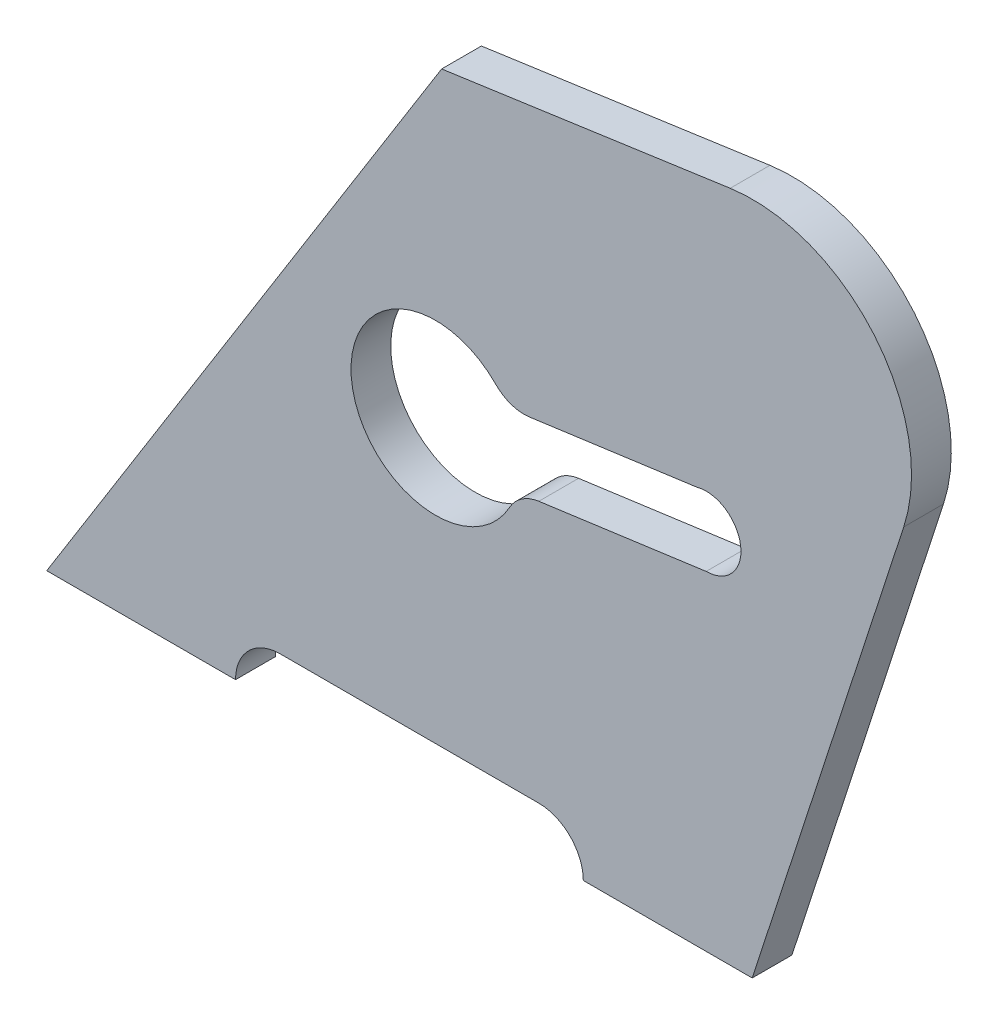
ISO-10303-21;
HEADER;
FILE_DESCRIPTION(('STEP AP214'),'2;1');
FILE_NAME('part.step','',(''),(''),'','','');
FILE_SCHEMA(('AUTOMOTIVE_DESIGN { 1 0 10303 214 1 1 1 1 }'));
ENDSEC;
DATA;
#1=APPLICATION_CONTEXT('core data for automotive mechanical design processes');
#2=APPLICATION_PROTOCOL_DEFINITION('international standard','automotive_design',2000,#1);
#3=PRODUCT_CONTEXT('',#1,'mechanical');
#4=PRODUCT('Part','Part','',(#3));
#5=PRODUCT_RELATED_PRODUCT_CATEGORY('part','',(#4));
#6=PRODUCT_DEFINITION_FORMATION('','',#4);
#7=PRODUCT_DEFINITION_CONTEXT('part definition',#1,'design');
#8=PRODUCT_DEFINITION('design','',#6,#7);
#9=PRODUCT_DEFINITION_SHAPE('','',#8);
#10=(LENGTH_UNIT() NAMED_UNIT(*) SI_UNIT(.MILLI.,.METRE.));
#11=(NAMED_UNIT(*) PLANE_ANGLE_UNIT() SI_UNIT($,.RADIAN.));
#12=(NAMED_UNIT(*) SI_UNIT($,.STERADIAN.) SOLID_ANGLE_UNIT());
#13=UNCERTAINTY_MEASURE_WITH_UNIT(LENGTH_MEASURE(1.E-05),#10,'distance_accuracy_value','');
#14=(GEOMETRIC_REPRESENTATION_CONTEXT(3) GLOBAL_UNCERTAINTY_ASSIGNED_CONTEXT((#13)) GLOBAL_UNIT_ASSIGNED_CONTEXT((#10,
#11,#12)) REPRESENTATION_CONTEXT('',''));
#15=CARTESIAN_POINT('',(0.,0.,0.));
#16=DIRECTION('',(0.,0.,1.));
#17=DIRECTION('',(1.,0.,0.));
#18=AXIS2_PLACEMENT_3D('',#15,#16,#17);
#19=CARTESIAN_POINT('',(128.440206600621,-41.7327529127653,8.));
#20=DIRECTION('',(-0.951056516295154,0.309016994374945,0.));
#21=DIRECTION('',(-0.309016994374945,-0.951056516295154,0.));
#22=AXIS2_PLACEMENT_3D('',#19,#20,#21);
#23=PLANE('',#22);
#24=DIRECTION('',(0.309016994374945,0.951056516295154,0.));
#25=VECTOR('',#24,1.);
#26=CARTESIAN_POINT('',(128.440206600621,-41.7327529127653,0.));
#27=LINE('',#26,#25);
#28=CARTESIAN_POINT('',(142.,0.,0.));
#29=VERTEX_POINT('',#28);
#30=CARTESIAN_POINT('',(172.503548140475,93.8802679373731,0.));
#31=VERTEX_POINT('',#30);
#32=EDGE_CURVE('E213',#29,#31,#27,.T.);
#33=ORIENTED_EDGE('',*,*,#32,.T.);
#34=DIRECTION('',(0.,0.,-1.));
#35=VECTOR('',#34,1.);
#36=CARTESIAN_POINT('',(172.503548140475,93.8802679373731,8.));
#37=LINE('',#36,#35);
#38=CARTESIAN_POINT('',(172.503548140475,93.8802679373731,8.));
#39=VERTEX_POINT('',#38);
#40=EDGE_CURVE('E11',#39,#31,#37,.T.);
#41=ORIENTED_EDGE('',*,*,#40,.F.);
#42=DIRECTION('',(0.309016994374945,0.951056516295154,0.));
#43=VECTOR('',#42,1.);
#44=CARTESIAN_POINT('',(128.440206600621,-41.7327529127653,8.));
#45=LINE('',#44,#43);
#46=CARTESIAN_POINT('',(142.,0.,8.));
#47=VERTEX_POINT('',#46);
#48=EDGE_CURVE('E317',#47,#39,#45,.T.);
#49=ORIENTED_EDGE('',*,*,#48,.F.);
#50=DIRECTION('',(0.,0.,-1.));
#51=VECTOR('',#50,1.);
#52=CARTESIAN_POINT('',(142.,0.,8.));
#53=LINE('',#52,#51);
#54=EDGE_CURVE('E242',#47,#29,#53,.T.);
#55=ORIENTED_EDGE('',*,*,#54,.T.);
#56=EDGE_LOOP('',(#33,#41,#49,#55));
#57=FACE_BOUND('',#56,.T.);
#58=ADVANCED_FACE('F45',(#57),#23,.F.);
#59=CARTESIAN_POINT('',(142.06973961903,103.768811757372,8.));
#60=DIRECTION('',(0.,0.,-1.));
#61=DIRECTION('',(-1.,0.,0.));
#62=AXIS2_PLACEMENT_3D('',#59,#60,#61);
#63=CYLINDRICAL_SURFACE('',#62,32.);
#64=CARTESIAN_POINT('',(142.06973961903,103.768811757372,0.));
#65=DIRECTION('',(0.,0.,1.));
#66=DIRECTION('',(1.,0.,0.));
#67=AXIS2_PLACEMENT_3D('',#64,#65,#66);
#68=CIRCLE('',#67,32.);
#69=CARTESIAN_POINT('',(137.573015723533,135.451290735628,0.));
#70=VERTEX_POINT('',#69);
#71=EDGE_CURVE('E217',#31,#70,#68,.T.);
#72=ORIENTED_EDGE('',*,*,#71,.T.);
#73=DIRECTION('',(0.,0.,-1.));
#74=VECTOR('',#73,1.);
#75=CARTESIAN_POINT('',(137.573015723533,135.451290735628,8.));
#76=LINE('',#75,#74);
#77=CARTESIAN_POINT('',(137.573015723533,135.451290735628,8.));
#78=VERTEX_POINT('',#77);
#79=EDGE_CURVE('E56',#78,#70,#76,.T.);
#80=ORIENTED_EDGE('',*,*,#79,.F.);
#81=CARTESIAN_POINT('',(142.06973961903,103.768811757372,8.));
#82=DIRECTION('',(0.,0.,1.));
#83=DIRECTION('',(1.,0.,0.));
#84=AXIS2_PLACEMENT_3D('',#81,#82,#83);
#85=CIRCLE('',#84,32.);
#86=EDGE_CURVE('E320',#39,#78,#85,.T.);
#87=ORIENTED_EDGE('',*,*,#86,.F.);
#88=ORIENTED_EDGE('',*,*,#40,.T.);
#89=EDGE_LOOP('',(#72,#80,#87,#88));
#90=FACE_BOUND('',#89,.T.);
#91=ADVANCED_FACE('F357',(#90),#63,.T.);
#92=CARTESIAN_POINT('',(-16.1285050060779,113.636290037189,8.));
#93=DIRECTION('',(0.140522621734258,-0.99007746807052,0.));
#94=DIRECTION('',(0.99007746807052,0.140522621734258,0.));
#95=AXIS2_PLACEMENT_3D('',#92,#93,#94);
#96=PLANE('',#95);
#97=DIRECTION('',(-0.99007746807052,-0.140522621734258,0.));
#98=VECTOR('',#97,1.);
#99=CARTESIAN_POINT('',(-16.1285050060779,113.636290037189,0.));
#100=LINE('',#99,#98);
#101=CARTESIAN_POINT('',(79.4878896349813,127.207214423464,0.));
#102=VERTEX_POINT('',#101);
#103=EDGE_CURVE('E220',#70,#102,#100,.T.);
#104=ORIENTED_EDGE('',*,*,#103,.T.);
#105=DIRECTION('',(0.,0.,-1.));
#106=VECTOR('',#105,1.);
#107=CARTESIAN_POINT('',(79.4878896349813,127.207214423464,8.));
#108=LINE('',#107,#106);
#109=CARTESIAN_POINT('',(79.4878896349813,127.207214423464,8.));
#110=VERTEX_POINT('',#109);
#111=EDGE_CURVE('E256',#110,#102,#108,.T.);
#112=ORIENTED_EDGE('',*,*,#111,.F.);
#113=DIRECTION('',(-0.99007746807052,-0.140522621734258,0.));
#114=VECTOR('',#113,1.);
#115=CARTESIAN_POINT('',(-16.1285050060779,113.636290037189,8.));
#116=LINE('',#115,#114);
#117=EDGE_CURVE('E323',#78,#110,#116,.T.);
#118=ORIENTED_EDGE('',*,*,#117,.F.);
#119=ORIENTED_EDGE('',*,*,#79,.T.);
#120=EDGE_LOOP('',(#104,#112,#118,#119));
#121=FACE_BOUND('',#120,.T.);
#122=ADVANCED_FACE('F362',(#121),#96,.F.);
#123=CARTESIAN_POINT('',(0.,0.,8.));
#124=DIRECTION('',(0.848048096156424,-0.529919264233209,0.));
#125=DIRECTION('',(0.529919264233209,0.848048096156424,0.));
#126=AXIS2_PLACEMENT_3D('',#123,#124,#125);
#127=PLANE('',#126);
#128=DIRECTION('',(-0.529919264233209,-0.848048096156424,0.));
#129=VECTOR('',#128,1.);
#130=CARTESIAN_POINT('',(0.,0.,0.));
#131=LINE('',#130,#129);
#132=CARTESIAN_POINT('',(0.,0.,0.));
#133=VERTEX_POINT('',#132);
#134=EDGE_CURVE('E223',#102,#133,#131,.T.);
#135=ORIENTED_EDGE('',*,*,#134,.T.);
#136=DIRECTION('',(0.,0.,-1.));
#137=VECTOR('',#136,1.);
#138=CARTESIAN_POINT('',(0.,0.,8.));
#139=LINE('',#138,#137);
#140=CARTESIAN_POINT('',(0.,0.,8.));
#141=VERTEX_POINT('',#140);
#142=EDGE_CURVE('E252',#141,#133,#139,.T.);
#143=ORIENTED_EDGE('',*,*,#142,.F.);
#144=DIRECTION('',(-0.529919264233209,-0.848048096156424,0.));
#145=VECTOR('',#144,1.);
#146=CARTESIAN_POINT('',(0.,0.,8.));
#147=LINE('',#146,#145);
#148=EDGE_CURVE('E326',#110,#141,#147,.T.);
#149=ORIENTED_EDGE('',*,*,#148,.F.);
#150=ORIENTED_EDGE('',*,*,#111,.T.);
#151=EDGE_LOOP('',(#135,#143,#149,#150));
#152=FACE_BOUND('',#151,.T.);
#153=ADVANCED_FACE('F390',(#152),#127,.F.);
#154=CARTESIAN_POINT('',(0.,0.,8.));
#155=DIRECTION('',(0.,1.,0.));
#156=DIRECTION('',(0.,0.,1.));
#157=AXIS2_PLACEMENT_3D('',#154,#155,#156);
#158=PLANE('',#157);
#159=DIRECTION('',(1.,0.,0.));
#160=VECTOR('',#159,1.);
#161=CARTESIAN_POINT('',(0.,0.,0.));
#162=LINE('',#161,#160);
#163=CARTESIAN_POINT('',(38.,0.,0.));
#164=VERTEX_POINT('',#163);
#165=EDGE_CURVE('E226',#133,#164,#162,.T.);
#166=ORIENTED_EDGE('',*,*,#165,.T.);
#167=DIRECTION('',(0.,0.,-1.));
#168=VECTOR('',#167,1.);
#169=CARTESIAN_POINT('',(38.,0.,8.));
#170=LINE('',#169,#168);
#171=CARTESIAN_POINT('',(38.,0.,8.));
#172=VERTEX_POINT('',#171);
#173=EDGE_CURVE('E249',#172,#164,#170,.T.);
#174=ORIENTED_EDGE('',*,*,#173,.F.);
#175=DIRECTION('',(1.,0.,0.));
#176=VECTOR('',#175,1.);
#177=CARTESIAN_POINT('',(0.,0.,8.));
#178=LINE('',#177,#176);
#179=EDGE_CURVE('E329',#141,#172,#178,.T.);
#180=ORIENTED_EDGE('',*,*,#179,.F.);
#181=ORIENTED_EDGE('',*,*,#142,.T.);
#182=EDGE_LOOP('',(#166,#174,#180,#181));
#183=FACE_BOUND('',#182,.T.);
#184=ADVANCED_FACE('F387',(#183),#158,.F.);
#185=CARTESIAN_POINT('',(47.,0.,8.));
#186=DIRECTION('',(0.,0.,-1.));
#187=DIRECTION('',(-1.,0.,0.));
#188=AXIS2_PLACEMENT_3D('',#185,#186,#187);
#189=CYLINDRICAL_SURFACE('',#188,9.);
#190=CARTESIAN_POINT('',(47.,0.,0.));
#191=DIRECTION('',(0.,0.,1.));
#192=DIRECTION('',(1.,0.,0.));
#193=AXIS2_PLACEMENT_3D('',#190,#191,#192);
#194=CIRCLE('',#193,9.);
#195=CARTESIAN_POINT('',(47.,9.,0.));
#196=VERTEX_POINT('',#195);
#197=EDGE_CURVE('E230',#196,#164,#194,.T.);
#198=ORIENTED_EDGE('',*,*,#197,.F.);
#199=DIRECTION('',(0.,0.,-1.));
#200=VECTOR('',#199,1.);
#201=CARTESIAN_POINT('',(47.,9.,8.));
#202=LINE('',#201,#200);
#203=CARTESIAN_POINT('',(47.,9.,8.));
#204=VERTEX_POINT('',#203);
#205=EDGE_CURVE('E180',#204,#196,#202,.T.);
#206=ORIENTED_EDGE('',*,*,#205,.F.);
#207=CARTESIAN_POINT('',(47.,0.,8.));
#208=DIRECTION('',(0.,0.,1.));
#209=DIRECTION('',(1.,0.,0.));
#210=AXIS2_PLACEMENT_3D('',#207,#208,#209);
#211=CIRCLE('',#210,9.);
#212=EDGE_CURVE('E167',#204,#172,#211,.T.);
#213=ORIENTED_EDGE('',*,*,#212,.T.);
#214=ORIENTED_EDGE('',*,*,#173,.T.);
#215=EDGE_LOOP('',(#198,#206,#213,#214));
#216=FACE_BOUND('',#215,.T.);
#217=ADVANCED_FACE('F334',(#216),#189,.F.);
#218=CARTESIAN_POINT('',(0.,9.,8.));
#219=DIRECTION('',(0.,1.,0.));
#220=DIRECTION('',(0.,0.,1.));
#221=AXIS2_PLACEMENT_3D('',#218,#219,#220);
#222=PLANE('',#221);
#223=DIRECTION('',(1.,0.,0.));
#224=VECTOR('',#223,1.);
#225=CARTESIAN_POINT('',(0.,9.,0.));
#226=LINE('',#225,#224);
#227=CARTESIAN_POINT('',(99.,9.,0.));
#228=VERTEX_POINT('',#227);
#229=EDGE_CURVE('E175',#196,#228,#226,.T.);
#230=ORIENTED_EDGE('',*,*,#229,.T.);
#231=DIRECTION('',(0.,0.,-1.));
#232=VECTOR('',#231,1.);
#233=CARTESIAN_POINT('',(99.,9.,8.));
#234=LINE('',#233,#232);
#235=CARTESIAN_POINT('',(99.,9.,8.));
#236=VERTEX_POINT('',#235);
#237=EDGE_CURVE('E172',#236,#228,#234,.T.);
#238=ORIENTED_EDGE('',*,*,#237,.F.);
#239=DIRECTION('',(1.,0.,0.));
#240=VECTOR('',#239,1.);
#241=CARTESIAN_POINT('',(0.,9.,8.));
#242=LINE('',#241,#240);
#243=EDGE_CURVE('E161',#204,#236,#242,.T.);
#244=ORIENTED_EDGE('',*,*,#243,.F.);
#245=ORIENTED_EDGE('',*,*,#205,.T.);
#246=EDGE_LOOP('',(#230,#238,#244,#245));
#247=FACE_BOUND('',#246,.T.);
#248=ADVANCED_FACE('F173',(#247),#222,.F.);
#249=CARTESIAN_POINT('',(99.,0.,8.));
#250=DIRECTION('',(0.,0.,-1.));
#251=DIRECTION('',(-1.,0.,0.));
#252=AXIS2_PLACEMENT_3D('',#249,#250,#251);
#253=CYLINDRICAL_SURFACE('',#252,9.);
#254=CARTESIAN_POINT('',(99.,0.,0.));
#255=DIRECTION('',(0.,0.,1.));
#256=DIRECTION('',(1.,0.,0.));
#257=AXIS2_PLACEMENT_3D('',#254,#255,#256);
#258=CIRCLE('',#257,9.);
#259=CARTESIAN_POINT('',(108.,0.,0.));
#260=VERTEX_POINT('',#259);
#261=EDGE_CURVE('E236',#260,#228,#258,.T.);
#262=ORIENTED_EDGE('',*,*,#261,.F.);
#263=DIRECTION('',(0.,0.,-1.));
#264=VECTOR('',#263,1.);
#265=CARTESIAN_POINT('',(108.,0.,8.));
#266=LINE('',#265,#264);
#267=CARTESIAN_POINT('',(108.,0.,8.));
#268=VERTEX_POINT('',#267);
#269=EDGE_CURVE('E114',#268,#260,#266,.T.);
#270=ORIENTED_EDGE('',*,*,#269,.F.);
#271=CARTESIAN_POINT('',(99.,0.,8.));
#272=DIRECTION('',(0.,0.,1.));
#273=DIRECTION('',(1.,0.,0.));
#274=AXIS2_PLACEMENT_3D('',#271,#272,#273);
#275=CIRCLE('',#274,9.);
#276=EDGE_CURVE('E165',#268,#236,#275,.T.);
#277=ORIENTED_EDGE('',*,*,#276,.T.);
#278=ORIENTED_EDGE('',*,*,#237,.T.);
#279=EDGE_LOOP('',(#262,#270,#277,#278));
#280=FACE_BOUND('',#279,.T.);
#281=ADVANCED_FACE('F182',(#280),#253,.F.);
#282=CARTESIAN_POINT('',(96.0798171445693,83.2965016603901,8.));
#283=DIRECTION('',(0.,0.,-1.));
#284=DIRECTION('',(-1.,0.,0.));
#285=AXIS2_PLACEMENT_3D('',#282,#283,#284);
#286=CYLINDRICAL_SURFACE('',#285,8.);
#287=CARTESIAN_POINT('',(96.0798171445693,83.2965016603901,0.));
#288=DIRECTION('',(0.,0.,1.));
#289=DIRECTION('',(1.,0.,0.));
#290=AXIS2_PLACEMENT_3D('',#287,#288,#289);
#291=CIRCLE('',#290,8.);
#292=CARTESIAN_POINT('',(97.1659290276469,75.3705720002532,0.));
#293=VERTEX_POINT('',#292);
#294=CARTESIAN_POINT('',(90.3725659843101,77.6904973619864,0.));
#295=VERTEX_POINT('',#294);
#296=EDGE_CURVE('E190',#293,#295,#291,.F.);
#297=ORIENTED_EDGE('',*,*,#296,.F.);
#298=DIRECTION('',(0.,0.,-1.));
#299=VECTOR('',#298,1.);
#300=CARTESIAN_POINT('',(97.1659290276469,75.3705720002532,8.));
#301=LINE('',#300,#299);
#302=CARTESIAN_POINT('',(97.1659290276469,75.3705720002532,8.));
#303=VERTEX_POINT('',#302);
#304=EDGE_CURVE('E49',#303,#293,#301,.T.);
#305=ORIENTED_EDGE('',*,*,#304,.F.);
#306=CARTESIAN_POINT('',(96.0798171445693,83.2965016603901,8.));
#307=DIRECTION('',(0.,0.,1.));
#308=DIRECTION('',(1.,0.,0.));
#309=AXIS2_PLACEMENT_3D('',#306,#307,#308);
#310=CIRCLE('',#309,8.);
#311=CARTESIAN_POINT('',(90.3725659843101,77.6904973619864,8.));
#312=VERTEX_POINT('',#311);
#313=EDGE_CURVE('E241',#303,#312,#310,.F.);
#314=ORIENTED_EDGE('',*,*,#313,.T.);
#315=DIRECTION('',(0.,0.,-1.));
#316=VECTOR('',#315,1.);
#317=CARTESIAN_POINT('',(90.3725659843101,77.6904973619864,8.));
#318=LINE('',#317,#316);
#319=EDGE_CURVE('E186',#312,#295,#318,.T.);
#320=ORIENTED_EDGE('',*,*,#319,.T.);
#321=EDGE_LOOP('',(#297,#305,#314,#320));
#322=FACE_BOUND('',#321,.T.);
#323=ADVANCED_FACE('F47',(#322),#286,.T.);
#324=CARTESIAN_POINT('',(-8.34691885587556,60.9118570207322,8.));
#325=DIRECTION('',(0.135763985384698,-0.990741207517111,0.));
#326=DIRECTION('',(0.990741207517111,0.135763985384698,0.));
#327=AXIS2_PLACEMENT_3D('',#324,#325,#326);
#328=PLANE('',#327);
#329=DIRECTION('',(-0.990741207517111,-0.135763985384698,0.));
#330=VECTOR('',#329,1.);
#331=CARTESIAN_POINT('',(-8.34691885587556,60.9118570207322,0.));
#332=LINE('',#331,#330);
#333=CARTESIAN_POINT('',(130.852326034757,79.9867113878515,0.));
#334=VERTEX_POINT('',#333);
#335=EDGE_CURVE('E194',#334,#293,#332,.T.);
#336=ORIENTED_EDGE('',*,*,#335,.F.);
#337=DIRECTION('',(0.,0.,-1.));
#338=VECTOR('',#337,1.);
#339=CARTESIAN_POINT('',(130.852326034757,79.9867113878515,8.));
#340=LINE('',#339,#338);
#341=CARTESIAN_POINT('',(130.852326034757,79.9867113878515,8.));
#342=VERTEX_POINT('',#341);
#343=EDGE_CURVE('E274',#342,#334,#340,.T.);
#344=ORIENTED_EDGE('',*,*,#343,.F.);
#345=DIRECTION('',(-0.990741207517111,-0.135763985384698,0.));
#346=VECTOR('',#345,1.);
#347=CARTESIAN_POINT('',(-8.34691885587556,60.9118570207322,8.));
#348=LINE('',#347,#346);
#349=EDGE_CURVE('E285',#342,#303,#348,.T.);
#350=ORIENTED_EDGE('',*,*,#349,.T.);
#351=ORIENTED_EDGE('',*,*,#304,.T.);
#352=EDGE_LOOP('',(#336,#344,#350,#351));
#353=FACE_BOUND('',#352,.T.);
#354=ADVANCED_FACE('F283',(#353),#328,.T.);
#355=CARTESIAN_POINT('',(132.735423682201,73.244757424037,8.));
#356=DIRECTION('',(0.,0.,-1.));
#357=DIRECTION('',(-1.,0.,0.));
#358=AXIS2_PLACEMENT_3D('',#355,#356,#357);
#359=CYLINDRICAL_SURFACE('',#358,7.00000000000002);
#360=CARTESIAN_POINT('',(132.735423682201,73.244757424037,0.));
#361=DIRECTION('',(0.,0.,1.));
#362=DIRECTION('',(1.,0.,0.));
#363=AXIS2_PLACEMENT_3D('',#360,#361,#362);
#364=CIRCLE('',#363,7.00000000000002);
#365=CARTESIAN_POINT('',(132.7354236822,66.244757424037,0.));
#366=VERTEX_POINT('',#365);
#367=EDGE_CURVE('E198',#366,#334,#364,.T.);
#368=ORIENTED_EDGE('',*,*,#367,.F.);
#369=DIRECTION('',(0.,0.,-1.));
#370=VECTOR('',#369,1.);
#371=CARTESIAN_POINT('',(132.7354236822,66.244757424037,8.));
#372=LINE('',#371,#370);
#373=CARTESIAN_POINT('',(132.7354236822,66.244757424037,8.));
#374=VERTEX_POINT('',#373);
#375=EDGE_CURVE('E272',#374,#366,#372,.T.);
#376=ORIENTED_EDGE('',*,*,#375,.F.);
#377=CARTESIAN_POINT('',(132.735423682201,73.244757424037,8.));
#378=DIRECTION('',(0.,0.,1.));
#379=DIRECTION('',(1.,0.,0.));
#380=AXIS2_PLACEMENT_3D('',#377,#378,#379);
#381=CIRCLE('',#380,7.00000000000002);
#382=EDGE_CURVE('E295',#374,#342,#381,.T.);
#383=ORIENTED_EDGE('',*,*,#382,.T.);
#384=ORIENTED_EDGE('',*,*,#343,.T.);
#385=EDGE_LOOP('',(#368,#376,#383,#384));
#386=FACE_BOUND('',#385,.T.);
#387=ADVANCED_FACE('F292',(#386),#359,.F.);
#388=CARTESIAN_POINT('',(-6.46382120843234,47.1699030569178,8.));
#389=DIRECTION('',(0.135763985384697,-0.990741207517111,0.));
#390=DIRECTION('',(0.990741207517111,0.135763985384697,0.));
#391=AXIS2_PLACEMENT_3D('',#388,#389,#390);
#392=PLANE('',#391);
#393=DIRECTION('',(-0.990741207517111,-0.135763985384697,0.));
#394=VECTOR('',#393,1.);
#395=CARTESIAN_POINT('',(-6.46382120843234,47.1699030569178,0.));
#396=LINE('',#395,#394);
#397=CARTESIAN_POINT('',(99.0490266750901,61.6286180364387,0.));
#398=VERTEX_POINT('',#397);
#399=EDGE_CURVE('E202',#366,#398,#396,.T.);
#400=ORIENTED_EDGE('',*,*,#399,.T.);
#401=DIRECTION('',(0.,0.,-1.));
#402=VECTOR('',#401,1.);
#403=CARTESIAN_POINT('',(99.0490266750901,61.6286180364387,8.));
#404=LINE('',#403,#402);
#405=CARTESIAN_POINT('',(99.0490266750901,61.6286180364387,8.));
#406=VERTEX_POINT('',#405);
#407=EDGE_CURVE('E268',#406,#398,#404,.T.);
#408=ORIENTED_EDGE('',*,*,#407,.F.);
#409=DIRECTION('',(-0.990741207517111,-0.135763985384697,0.));
#410=VECTOR('',#409,1.);
#411=CARTESIAN_POINT('',(-6.46382120843234,47.1699030569178,8.));
#412=LINE('',#411,#410);
#413=EDGE_CURVE('E298',#374,#406,#412,.T.);
#414=ORIENTED_EDGE('',*,*,#413,.F.);
#415=ORIENTED_EDGE('',*,*,#375,.T.);
#416=EDGE_LOOP('',(#400,#408,#414,#415));
#417=FACE_BOUND('',#416,.T.);
#418=ADVANCED_FACE('F299',(#417),#392,.F.);
#419=CARTESIAN_POINT('',(100.135138558168,53.7026883763018,8.));
#420=DIRECTION('',(0.,0.,-1.));
#421=DIRECTION('',(-1.,0.,0.));
#422=AXIS2_PLACEMENT_3D('',#419,#420,#421);
#423=CYLINDRICAL_SURFACE('',#422,7.99999999999999);
#424=CARTESIAN_POINT('',(100.135138558168,53.7026883763018,0.));
#425=DIRECTION('',(0.,0.,1.));
#426=DIRECTION('',(1.,0.,0.));
#427=AXIS2_PLACEMENT_3D('',#424,#425,#426);
#428=CIRCLE('',#427,7.99999999999999);
#429=CARTESIAN_POINT('',(93.130184545557,57.5667043288064,0.));
#430=VERTEX_POINT('',#429);
#431=EDGE_CURVE('E205',#398,#430,#428,.T.);
#432=ORIENTED_EDGE('',*,*,#431,.T.);
#433=DIRECTION('',(0.,0.,-1.));
#434=VECTOR('',#433,1.);
#435=CARTESIAN_POINT('',(93.130184545557,57.5667043288064,8.));
#436=LINE('',#435,#434);
#437=CARTESIAN_POINT('',(93.130184545557,57.5667043288064,8.));
#438=VERTEX_POINT('',#437);
#439=EDGE_CURVE('E265',#438,#430,#436,.T.);
#440=ORIENTED_EDGE('',*,*,#439,.F.);
#441=CARTESIAN_POINT('',(100.135138558168,53.7026883763018,8.));
#442=DIRECTION('',(0.,0.,1.));
#443=DIRECTION('',(1.,0.,0.));
#444=AXIS2_PLACEMENT_3D('',#441,#442,#443);
#445=CIRCLE('',#444,7.99999999999999);
#446=EDGE_CURVE('E303',#406,#438,#445,.T.);
#447=ORIENTED_EDGE('',*,*,#446,.F.);
#448=ORIENTED_EDGE('',*,*,#407,.T.);
#449=EDGE_LOOP('',(#432,#440,#447,#448));
#450=FACE_BOUND('',#449,.T.);
#451=ADVANCED_FACE('F351',(#450),#423,.T.);
#452=CARTESIAN_POINT('',(78.2446572687594,65.7777382278787,8.));
#453=DIRECTION('',(0.,0.,-1.));
#454=DIRECTION('',(-1.,0.,0.));
#455=AXIS2_PLACEMENT_3D('',#452,#453,#454);
#456=CYLINDRICAL_SURFACE('',#455,17.);
#457=CARTESIAN_POINT('',(78.2446572687594,65.7777382278787,0.));
#458=DIRECTION('',(0.,0.,1.));
#459=DIRECTION('',(1.,0.,0.));
#460=AXIS2_PLACEMENT_3D('',#457,#458,#459);
#461=CIRCLE('',#460,17.);
#462=EDGE_CURVE('E209',#295,#430,#461,.T.);
#463=ORIENTED_EDGE('',*,*,#462,.F.);
#464=ORIENTED_EDGE('',*,*,#319,.F.);
#465=CARTESIAN_POINT('',(78.2446572687594,65.7777382278787,8.));
#466=DIRECTION('',(0.,0.,1.));
#467=DIRECTION('',(1.,0.,0.));
#468=AXIS2_PLACEMENT_3D('',#465,#466,#467);
#469=CIRCLE('',#468,17.);
#470=EDGE_CURVE('E313',#312,#438,#469,.T.);
#471=ORIENTED_EDGE('',*,*,#470,.T.);
#472=ORIENTED_EDGE('',*,*,#439,.T.);
#473=EDGE_LOOP('',(#463,#464,#471,#472));
#474=FACE_BOUND('',#473,.T.);
#475=ADVANCED_FACE('F344',(#474),#456,.F.);
#476=CARTESIAN_POINT('',(0.,0.,8.));
#477=DIRECTION('',(0.,1.,0.));
#478=DIRECTION('',(0.,0.,1.));
#479=AXIS2_PLACEMENT_3D('',#476,#477,#478);
#480=PLANE('',#479);
#481=DIRECTION('',(1.,0.,0.));
#482=VECTOR('',#481,1.);
#483=CARTESIAN_POINT('',(0.,0.,0.));
#484=LINE('',#483,#482);
#485=EDGE_CURVE('E117',#260,#29,#484,.T.);
#486=ORIENTED_EDGE('',*,*,#485,.T.);
#487=ORIENTED_EDGE('',*,*,#54,.F.);
#488=DIRECTION('',(1.,0.,0.));
#489=VECTOR('',#488,1.);
#490=CARTESIAN_POINT('',(0.,0.,8.));
#491=LINE('',#490,#489);
#492=EDGE_CURVE('E65',#268,#47,#491,.T.);
#493=ORIENTED_EDGE('',*,*,#492,.F.);
#494=ORIENTED_EDGE('',*,*,#269,.T.);
#495=EDGE_LOOP('',(#486,#487,#493,#494));
#496=FACE_BOUND('',#495,.T.);
#497=ADVANCED_FACE('F342',(#496),#480,.F.);
#498=CARTESIAN_POINT('',(0.,0.,8.));
#499=DIRECTION('',(0.,0.,1.));
#500=DIRECTION('',(1.,0.,0.));
#501=AXIS2_PLACEMENT_3D('',#498,#499,#500);
#502=PLANE('',#501);
#503=ORIENTED_EDGE('',*,*,#313,.F.);
#504=ORIENTED_EDGE('',*,*,#349,.F.);
#505=ORIENTED_EDGE('',*,*,#382,.F.);
#506=ORIENTED_EDGE('',*,*,#413,.T.);
#507=ORIENTED_EDGE('',*,*,#446,.T.);
#508=ORIENTED_EDGE('',*,*,#470,.F.);
#509=EDGE_LOOP('',(#503,#504,#505,#506,#507,#508));
#510=FACE_BOUND('',#509,.T.);
#511=ORIENTED_EDGE('',*,*,#48,.T.);
#512=ORIENTED_EDGE('',*,*,#86,.T.);
#513=ORIENTED_EDGE('',*,*,#117,.T.);
#514=ORIENTED_EDGE('',*,*,#148,.T.);
#515=ORIENTED_EDGE('',*,*,#179,.T.);
#516=ORIENTED_EDGE('',*,*,#212,.F.);
#517=ORIENTED_EDGE('',*,*,#243,.T.);
#518=ORIENTED_EDGE('',*,*,#276,.F.);
#519=ORIENTED_EDGE('',*,*,#492,.T.);
#520=EDGE_LOOP('',(#511,#512,#513,#514,#515,#516,#517,#518,#519));
#521=FACE_BOUND('',#520,.T.);
#522=ADVANCED_FACE('F163',(#510,#521),#502,.T.);
#523=CARTESIAN_POINT('',(0.,0.,0.));
#524=DIRECTION('',(0.,0.,1.));
#525=DIRECTION('',(1.,0.,0.));
#526=AXIS2_PLACEMENT_3D('',#523,#524,#525);
#527=PLANE('',#526);
#528=ORIENTED_EDGE('',*,*,#296,.T.);
#529=ORIENTED_EDGE('',*,*,#462,.T.);
#530=ORIENTED_EDGE('',*,*,#431,.F.);
#531=ORIENTED_EDGE('',*,*,#399,.F.);
#532=ORIENTED_EDGE('',*,*,#367,.T.);
#533=ORIENTED_EDGE('',*,*,#335,.T.);
#534=EDGE_LOOP('',(#528,#529,#530,#531,#532,#533));
#535=FACE_BOUND('',#534,.T.);
#536=ORIENTED_EDGE('',*,*,#32,.F.);
#537=ORIENTED_EDGE('',*,*,#485,.F.);
#538=ORIENTED_EDGE('',*,*,#261,.T.);
#539=ORIENTED_EDGE('',*,*,#229,.F.);
#540=ORIENTED_EDGE('',*,*,#197,.T.);
#541=ORIENTED_EDGE('',*,*,#165,.F.);
#542=ORIENTED_EDGE('',*,*,#134,.F.);
#543=ORIENTED_EDGE('',*,*,#103,.F.);
#544=ORIENTED_EDGE('',*,*,#71,.F.);
#545=EDGE_LOOP('',(#536,#537,#538,#539,#540,#541,#542,#543,#544));
#546=FACE_BOUND('',#545,.T.);
#547=ADVANCED_FACE('F288',(#535,#546),#527,.F.);
#548=CLOSED_SHELL('',(#58,#91,#122,#153,#184,#217,#248,#281,#323,#354,#387,#418,#451,#475,#497,
#522,#547));
#549=MANIFOLD_SOLID_BREP('B2',#548);
#550=ADVANCED_BREP_SHAPE_REPRESENTATION('',(#18,#549),#14);
#551=SHAPE_DEFINITION_REPRESENTATION(#9,#550);
ENDSEC;
END-ISO-10303-21;
